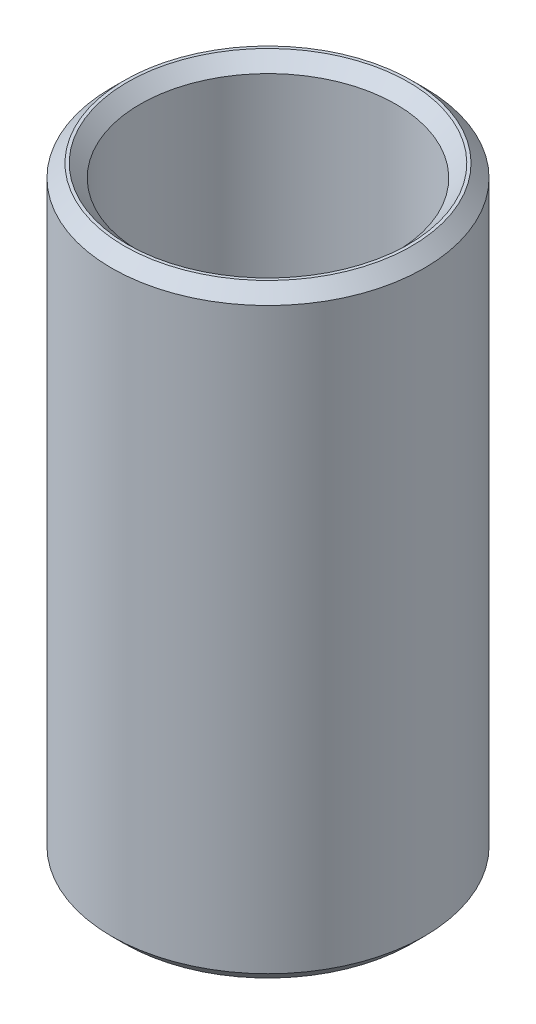
ISO-10303-21;
HEADER;
FILE_DESCRIPTION(('STEP AP214'),'2;1');
FILE_NAME('part.step','',(''),(''),'','','');
FILE_SCHEMA(('AUTOMOTIVE_DESIGN { 1 0 10303 214 1 1 1 1 }'));
ENDSEC;
DATA;
#1=APPLICATION_CONTEXT('core data for automotive mechanical design processes');
#2=APPLICATION_PROTOCOL_DEFINITION('international standard','automotive_design',2000,#1);
#3=PRODUCT_CONTEXT('',#1,'mechanical');
#4=PRODUCT('Part','Part','',(#3));
#5=PRODUCT_RELATED_PRODUCT_CATEGORY('part','',(#4));
#6=PRODUCT_DEFINITION_FORMATION('','',#4);
#7=PRODUCT_DEFINITION_CONTEXT('part definition',#1,'design');
#8=PRODUCT_DEFINITION('design','',#6,#7);
#9=PRODUCT_DEFINITION_SHAPE('','',#8);
#10=(LENGTH_UNIT() NAMED_UNIT(*) SI_UNIT(.MILLI.,.METRE.));
#11=(NAMED_UNIT(*) PLANE_ANGLE_UNIT() SI_UNIT($,.RADIAN.));
#12=(NAMED_UNIT(*) SI_UNIT($,.STERADIAN.) SOLID_ANGLE_UNIT());
#13=UNCERTAINTY_MEASURE_WITH_UNIT(LENGTH_MEASURE(1.E-05),#10,'distance_accuracy_value','');
#14=(GEOMETRIC_REPRESENTATION_CONTEXT(3) GLOBAL_UNCERTAINTY_ASSIGNED_CONTEXT((#13)) GLOBAL_UNIT_ASSIGNED_CONTEXT((#10,
#11,#12)) REPRESENTATION_CONTEXT('',''));
#15=CARTESIAN_POINT('',(0.,0.,0.));
#16=DIRECTION('',(0.,0.,1.));
#17=DIRECTION('',(1.,0.,0.));
#18=AXIS2_PLACEMENT_3D('',#15,#16,#17);
#19=CARTESIAN_POINT('',(0.,144.931752547596,0.));
#20=DIRECTION('',(0.,-1.,0.));
#21=DIRECTION('',(0.,0.,-1.));
#22=AXIS2_PLACEMENT_3D('',#19,#20,#21);
#23=CYLINDRICAL_SURFACE('',#22,37.5);
#24=CARTESIAN_POINT('',(0.,3.05459785576065,0.));
#25=DIRECTION('',(0.,1.,0.));
#26=DIRECTION('',(0.,0.,1.));
#27=AXIS2_PLACEMENT_3D('',#24,#25,#26);
#28=CIRCLE('',#27,37.5);
#29=CARTESIAN_POINT('',(0.,3.05459785576065,37.5));
#30=VERTEX_POINT('',#29);
#31=EDGE_CURVE('E10',#30,#30,#28,.T.);
#32=ORIENTED_EDGE('',*,*,#31,.T.);
#33=EDGE_LOOP('',(#32));
#34=FACE_BOUND('',#33,.T.);
#35=CARTESIAN_POINT('',(0.,141.877154691836,0.));
#36=DIRECTION('',(0.,1.,0.));
#37=DIRECTION('',(0.,0.,1.));
#38=AXIS2_PLACEMENT_3D('',#35,#36,#37);
#39=CIRCLE('',#38,37.5);
#40=CARTESIAN_POINT('',(0.,141.877154691836,37.5));
#41=VERTEX_POINT('',#40);
#42=EDGE_CURVE('E50',#41,#41,#39,.F.);
#43=ORIENTED_EDGE('',*,*,#42,.T.);
#44=EDGE_LOOP('',(#43));
#45=FACE_BOUND('',#44,.T.);
#46=ADVANCED_FACE('F39',(#34,#45),#23,.T.);
#47=CARTESIAN_POINT('',(0.,144.931752547596,0.));
#48=DIRECTION('',(0.,1.,0.));
#49=DIRECTION('',(0.,0.,1.));
#50=AXIS2_PLACEMENT_3D('',#47,#48,#49);
#51=PLANE('',#50);
#52=CARTESIAN_POINT('',(0.,144.931752547596,0.));
#53=DIRECTION('',(0.,1.,0.));
#54=DIRECTION('',(0.,0.,1.));
#55=AXIS2_PLACEMENT_3D('',#52,#53,#54);
#56=CIRCLE('',#55,33.7234791078743);
#57=CARTESIAN_POINT('',(0.,144.931752547596,33.7234791078743));
#58=VERTEX_POINT('',#57);
#59=EDGE_CURVE('E58',#58,#58,#56,.F.);
#60=ORIENTED_EDGE('',*,*,#59,.T.);
#61=EDGE_LOOP('',(#60));
#62=FACE_BOUND('',#61,.T.);
#63=CARTESIAN_POINT('',(0.,144.931752547596,0.));
#64=DIRECTION('',(0.,1.,0.));
#65=DIRECTION('',(0.,0.,1.));
#66=AXIS2_PLACEMENT_3D('',#63,#64,#65);
#67=CIRCLE('',#66,34.4454021442393);
#68=CARTESIAN_POINT('',(0.,144.931752547596,34.4454021442393));
#69=VERTEX_POINT('',#68);
#70=EDGE_CURVE('E61',#69,#69,#67,.T.);
#71=ORIENTED_EDGE('',*,*,#70,.T.);
#72=EDGE_LOOP('',(#71));
#73=FACE_BOUND('',#72,.T.);
#74=ADVANCED_FACE('F88',(#62,#73),#51,.T.);
#75=CARTESIAN_POINT('',(0.,0.,0.));
#76=DIRECTION('',(0.,1.,0.));
#77=DIRECTION('',(0.,0.,1.));
#78=AXIS2_PLACEMENT_3D('',#75,#76,#77);
#79=PLANE('',#78);
#80=CARTESIAN_POINT('',(0.,0.,0.));
#81=DIRECTION('',(0.,1.,0.));
#82=DIRECTION('',(0.,0.,1.));
#83=AXIS2_PLACEMENT_3D('',#80,#81,#82);
#84=CIRCLE('',#83,33.7234791078743);
#85=CARTESIAN_POINT('',(0.,0.,-33.7234791078743));
#86=VERTEX_POINT('',#85);
#87=EDGE_CURVE('E51',#86,#86,#84,.T.);
#88=ORIENTED_EDGE('',*,*,#87,.T.);
#89=EDGE_LOOP('',(#88));
#90=FACE_BOUND('',#89,.T.);
#91=CARTESIAN_POINT('',(0.,0.,0.));
#92=DIRECTION('',(0.,1.,0.));
#93=DIRECTION('',(0.,0.,1.));
#94=AXIS2_PLACEMENT_3D('',#91,#92,#93);
#95=CIRCLE('',#94,34.4454021442393);
#96=CARTESIAN_POINT('',(0.,0.,34.4454021442393));
#97=VERTEX_POINT('',#96);
#98=EDGE_CURVE('E54',#97,#97,#95,.F.);
#99=ORIENTED_EDGE('',*,*,#98,.T.);
#100=EDGE_LOOP('',(#99));
#101=FACE_BOUND('',#100,.T.);
#102=ADVANCED_FACE('F83',(#90,#101),#79,.F.);
#103=CARTESIAN_POINT('',(0.,144.931752547596,0.));
#104=DIRECTION('',(0.,-1.,0.));
#105=DIRECTION('',(0.,0.,-1.));
#106=AXIS2_PLACEMENT_3D('',#103,#104,#105);
#107=CYLINDRICAL_SURFACE('',#106,30.6688812521136);
#108=CARTESIAN_POINT('',(0.,141.877154691836,0.));
#109=DIRECTION('',(0.,1.,0.));
#110=DIRECTION('',(0.,0.,1.));
#111=AXIS2_PLACEMENT_3D('',#108,#109,#110);
#112=CIRCLE('',#111,30.6688812521136);
#113=CARTESIAN_POINT('',(0.,141.877154691836,30.6688812521136));
#114=VERTEX_POINT('',#113);
#115=EDGE_CURVE('E67',#114,#114,#112,.T.);
#116=ORIENTED_EDGE('',*,*,#115,.T.);
#117=EDGE_LOOP('',(#116));
#118=FACE_BOUND('',#117,.T.);
#119=CARTESIAN_POINT('',(0.,3.05459785576068,0.));
#120=DIRECTION('',(0.,1.,0.));
#121=DIRECTION('',(0.,0.,1.));
#122=AXIS2_PLACEMENT_3D('',#119,#120,#121);
#123=CIRCLE('',#122,30.6688812521136);
#124=CARTESIAN_POINT('',(0.,3.05459785576068,-30.6688812521136));
#125=VERTEX_POINT('',#124);
#126=EDGE_CURVE('E69',#125,#125,#123,.F.);
#127=ORIENTED_EDGE('',*,*,#126,.T.);
#128=EDGE_LOOP('',(#127));
#129=FACE_BOUND('',#128,.T.);
#130=ADVANCED_FACE('F71',(#118,#129),#107,.F.);
#131=CARTESIAN_POINT('',(0.,141.877154691836,0.));
#132=DIRECTION('',(0.,1.,0.));
#133=DIRECTION('',(0.,0.,1.));
#134=AXIS2_PLACEMENT_3D('',#131,#132,#133);
#135=CONICAL_SURFACE('',#134,30.6688812521136,0.785398163397447);
#136=ORIENTED_EDGE('',*,*,#59,.F.);
#137=EDGE_LOOP('',(#136));
#138=FACE_BOUND('',#137,.T.);
#139=ORIENTED_EDGE('',*,*,#115,.F.);
#140=EDGE_LOOP('',(#139));
#141=FACE_BOUND('',#140,.T.);
#142=ADVANCED_FACE('F77',(#138,#141),#135,.F.);
#143=CARTESIAN_POINT('',(0.,0.,0.));
#144=DIRECTION('',(0.,-1.,0.));
#145=DIRECTION('',(0.,0.,-1.));
#146=AXIS2_PLACEMENT_3D('',#143,#144,#145);
#147=CONICAL_SURFACE('',#146,33.7234791078743,0.785398163397447);
#148=CARTESIAN_POINT('',(0.,3.05459785576068,-30.6688812521136));
#149=CARTESIAN_POINT('',(0.,3.0227791280965,-30.7006999797778));
#150=CARTESIAN_POINT('',(0.,2.99096040043233,-30.732518707442));
#151=CARTESIAN_POINT('',(0.,2.92732294510398,-30.7961561627703));
#152=CARTESIAN_POINT('',(0.,2.89550421743981,-30.8279748904345));
#153=CARTESIAN_POINT('',(0.,2.83186676211146,-30.8916123457628));
#154=CARTESIAN_POINT('',(0.,2.80004803444729,-30.923431073427));
#155=CARTESIAN_POINT('',(0.,2.73641057911894,-30.9870685287554));
#156=CARTESIAN_POINT('',(0.,2.70459185145477,-31.0188872564195));
#157=CARTESIAN_POINT('',(0.,2.64095439612642,-31.0825247117479));
#158=CARTESIAN_POINT('',(0.,2.60913566846224,-31.1143434394121));
#159=CARTESIAN_POINT('',(0.,2.5454982131339,-31.1779808947404));
#160=CARTESIAN_POINT('',(0.,2.51367948546972,-31.2097996224046));
#161=CARTESIAN_POINT('',(0.,2.45004203014138,-31.2734370777329));
#162=CARTESIAN_POINT('',(0.,2.4182233024772,-31.3052558053971));
#163=CARTESIAN_POINT('',(0.,2.35458584714886,-31.3688932607255));
#164=CARTESIAN_POINT('',(0.,2.32276711948468,-31.4007119883896));
#165=CARTESIAN_POINT('',(0.,2.25912966415633,-31.464349443718));
#166=CARTESIAN_POINT('',(0.,2.22731093649216,-31.4961681713821));
#167=CARTESIAN_POINT('',(0.,2.16367348116381,-31.5598056267105));
#168=CARTESIAN_POINT('',(0.,2.13185475349964,-31.5916243543747));
#169=CARTESIAN_POINT('',(0.,2.06821729817129,-31.655261809703));
#170=CARTESIAN_POINT('',(0.,2.03639857050712,-31.6870805373672));
#171=CARTESIAN_POINT('',(0.,1.97276111517877,-31.7507179926955));
#172=CARTESIAN_POINT('',(0.,1.9409423875146,-31.7825367203597));
#173=CARTESIAN_POINT('',(0.,1.87730493218625,-31.8461741756881));
#174=CARTESIAN_POINT('',(0.,1.84548620452207,-31.8779929033522));
#175=CARTESIAN_POINT('',(0.,1.78184874919373,-31.9416303586806));
#176=CARTESIAN_POINT('',(0.,1.75003002152955,-31.9734490863447));
#177=CARTESIAN_POINT('',(0.,1.68639256620121,-32.0370865416731));
#178=CARTESIAN_POINT('',(0.,1.65457383853703,-32.0689052693373));
#179=CARTESIAN_POINT('',(0.,1.59093638320869,-32.1325427246656));
#180=CARTESIAN_POINT('',(0.,1.55911765554451,-32.1643614523298));
#181=CARTESIAN_POINT('',(0.,1.49548020021617,-32.2279989076581));
#182=CARTESIAN_POINT('',(0.,1.46366147255199,-32.2598176353223));
#183=CARTESIAN_POINT('',(0.,1.40002401722364,-32.3234550906507));
#184=CARTESIAN_POINT('',(0.,1.36820528955947,-32.3552738183148));
#185=CARTESIAN_POINT('',(0.,1.30456783423112,-32.4189112736432));
#186=CARTESIAN_POINT('',(0.,1.27274910656695,-32.4507300013073));
#187=CARTESIAN_POINT('',(0.,1.2091116512386,-32.5143674566357));
#188=CARTESIAN_POINT('',(0.,1.17729292357443,-32.5461861842999));
#189=CARTESIAN_POINT('',(0.,1.11365546824608,-32.6098236396282));
#190=CARTESIAN_POINT('',(0.,1.08183674058191,-32.6416423672924));
#191=CARTESIAN_POINT('',(0.,1.01819928525356,-32.7052798226207));
#192=CARTESIAN_POINT('',(0.,0.986380557589384,-32.7370985502849));
#193=CARTESIAN_POINT('',(0.,0.922743102261037,-32.8007360056133));
#194=CARTESIAN_POINT('',(0.,0.890924374596865,-32.8325547332774));
#195=CARTESIAN_POINT('',(0.,0.827286919268517,-32.8961921886058));
#196=CARTESIAN_POINT('',(0.,0.795468191604342,-32.9280109162699));
#197=CARTESIAN_POINT('',(0.,0.731830736275995,-32.9916483715983));
#198=CARTESIAN_POINT('',(0.,0.700012008611822,-33.0234670992625));
#199=CARTESIAN_POINT('',(0.,0.636374553283475,-33.0871045545908));
#200=CARTESIAN_POINT('',(0.,0.6045558256193,-33.118923282255));
#201=CARTESIAN_POINT('',(0.,0.540918370290952,-33.1825607375833));
#202=CARTESIAN_POINT('',(0.,0.50909964262678,-33.2143794652475));
#203=CARTESIAN_POINT('',(0.,0.445462187298433,-33.2780169205759));
#204=CARTESIAN_POINT('',(0.,0.413643459634258,-33.30983564824));
#205=CARTESIAN_POINT('',(0.,0.35000600430591,-33.3734731035684));
#206=CARTESIAN_POINT('',(0.,0.318187276641738,-33.4052918312326));
#207=CARTESIAN_POINT('',(0.,0.25454982131339,-33.4689292865609));
#208=CARTESIAN_POINT('',(0.,0.222731093649216,-33.5007480142251));
#209=CARTESIAN_POINT('',(0.,0.159093638320868,-33.5643854695534));
#210=CARTESIAN_POINT('',(0.,0.127274910656695,-33.5962041972176));
#211=CARTESIAN_POINT('',(0.,0.0636374553283487,-33.6598416525459));
#212=CARTESIAN_POINT('',(0.,0.0318187276641756,-33.6916603802101));
#213=CARTESIAN_POINT('',(0.,0.,-33.7234791078743));
#214=B_SPLINE_CURVE_WITH_KNOTS('',3,(#148,#149,#150,#151,#152,#153,#154,#155,#156,#157,#158,
#159,#160,#161,#162,#163,#164,#165,#166,#167,#168,#169,#170,#171,#172,#173,#174,#175,#176,#177,
#178,#179,#180,#181,#182,#183,#184,#185,#186,#187,#188,#189,#190,#191,#192,#193,#194,#195,#196,
#197,#198,#199,#200,#201,#202,#203,#204,#205,#206,#207,#208,#209,#210,#211,#212,#213),
.UNSPECIFIED.,.F.,.F.,(4,2,2,2,2,2,2,2,2,2,2,2,2,2,2,2,2,2,2,2,2,2,2,2,2,2,2,2,2,2,2,2,4),(0.,
0.134995428600391,0.269990857200783,0.404986285801174,0.539981714401566,0.674977143001957,
0.809972571602346,0.94496800020274,1.07996342880313,1.21495885740352,1.34995428600391,
1.4849497146043,1.61994514320469,1.75494057180508,1.88993600040548,2.02493142900587,
2.15992685760626,2.29492228620665,2.42991771480704,2.56491314340743,2.69990857200782,
2.83490400060821,2.9698994292086,3.104894857809,3.23989028640939,3.37488571500978,
3.50988114361017,3.64487657221056,3.77987200081095,3.91486742941134,4.04986285801173,
4.18485828661213,4.31985371521252),.UNSPECIFIED.);
#215=EDGE_CURVE('BSEAM73',#125,#86,#214,.T.);
#216=ORIENTED_EDGE('',*,*,#126,.F.);
#217=ORIENTED_EDGE('',*,*,#87,.F.);
#218=ORIENTED_EDGE('',*,*,#215,.T.);
#219=ORIENTED_EDGE('',*,*,#215,.F.);
#220=EDGE_LOOP('',(#216,#218,#217,#219));
#221=FACE_BOUND('',#220,.T.);
#222=ADVANCED_FACE('F73',(#221),#147,.F.);
#223=CARTESIAN_POINT('',(0.,3.05459785576065,0.));
#224=DIRECTION('',(0.,1.,0.));
#225=DIRECTION('',(0.,0.,1.));
#226=AXIS2_PLACEMENT_3D('',#223,#224,#225);
#227=CONICAL_SURFACE('',#226,37.5,0.785398163397453);
#228=ORIENTED_EDGE('',*,*,#98,.F.);
#229=EDGE_LOOP('',(#228));
#230=FACE_BOUND('',#229,.T.);
#231=ORIENTED_EDGE('',*,*,#31,.F.);
#232=EDGE_LOOP('',(#231));
#233=FACE_BOUND('',#232,.T.);
#234=ADVANCED_FACE('F76',(#230,#233),#227,.T.);
#235=CARTESIAN_POINT('',(0.,144.931752547596,0.));
#236=DIRECTION('',(0.,-1.,0.));
#237=DIRECTION('',(0.,0.,-1.));
#238=AXIS2_PLACEMENT_3D('',#235,#236,#237);
#239=CONICAL_SURFACE('',#238,34.4454021442393,0.785398163397444);
#240=ORIENTED_EDGE('',*,*,#42,.F.);
#241=EDGE_LOOP('',(#240));
#242=FACE_BOUND('',#241,.T.);
#243=ORIENTED_EDGE('',*,*,#70,.F.);
#244=EDGE_LOOP('',(#243));
#245=FACE_BOUND('',#244,.T.);
#246=ADVANCED_FACE('F45',(#242,#245),#239,.T.);
#247=CLOSED_SHELL('',(#46,#74,#102,#130,#142,#222,#234,#246));
#248=MANIFOLD_SOLID_BREP('B2',#247);
#249=ADVANCED_BREP_SHAPE_REPRESENTATION('',(#18,#248),#14);
#250=SHAPE_DEFINITION_REPRESENTATION(#9,#249);
ENDSEC;
END-ISO-10303-21;
